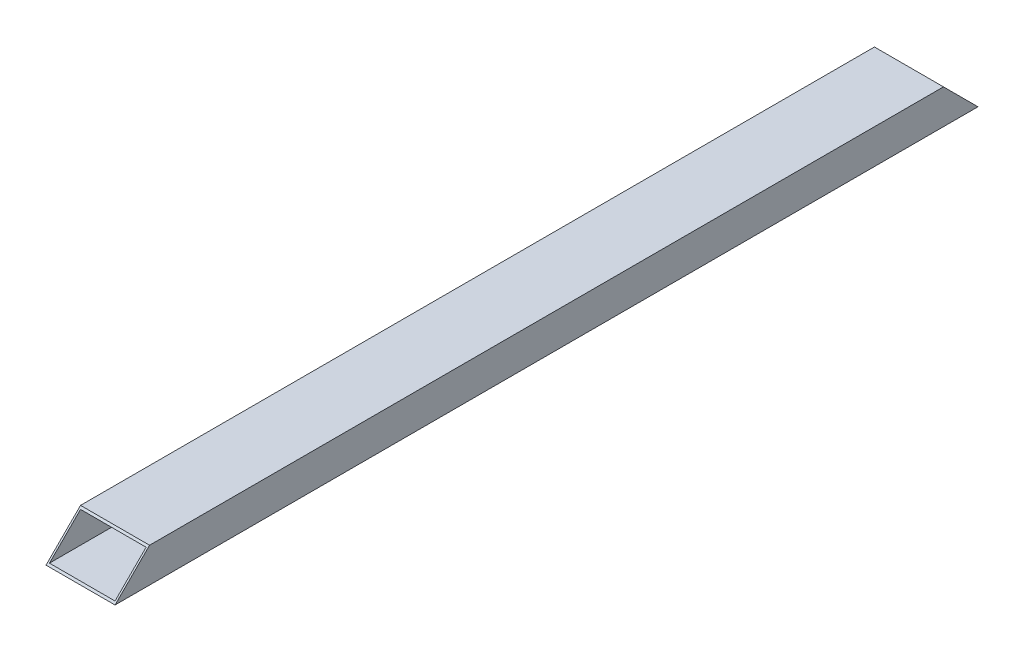
ISO-10303-21;
HEADER;
FILE_DESCRIPTION(('STEP AP214'),'2;1');
FILE_NAME('part.step','',(''),(''),'','','');
FILE_SCHEMA(('AUTOMOTIVE_DESIGN { 1 0 10303 214 1 1 1 1 }'));
ENDSEC;
DATA;
#1=APPLICATION_CONTEXT('core data for automotive mechanical design processes');
#2=APPLICATION_PROTOCOL_DEFINITION('international standard','automotive_design',2000,#1);
#3=PRODUCT_CONTEXT('',#1,'mechanical');
#4=PRODUCT('Part','Part','',(#3));
#5=PRODUCT_RELATED_PRODUCT_CATEGORY('part','',(#4));
#6=PRODUCT_DEFINITION_FORMATION('','',#4);
#7=PRODUCT_DEFINITION_CONTEXT('part definition',#1,'design');
#8=PRODUCT_DEFINITION('design','',#6,#7);
#9=PRODUCT_DEFINITION_SHAPE('','',#8);
#10=(LENGTH_UNIT() NAMED_UNIT(*) SI_UNIT(.MILLI.,.METRE.));
#11=(NAMED_UNIT(*) PLANE_ANGLE_UNIT() SI_UNIT($,.RADIAN.));
#12=(NAMED_UNIT(*) SI_UNIT($,.STERADIAN.) SOLID_ANGLE_UNIT());
#13=UNCERTAINTY_MEASURE_WITH_UNIT(LENGTH_MEASURE(1.E-05),#10,'distance_accuracy_value','');
#14=(GEOMETRIC_REPRESENTATION_CONTEXT(3) GLOBAL_UNCERTAINTY_ASSIGNED_CONTEXT((#13)) GLOBAL_UNIT_ASSIGNED_CONTEXT((#10,
#11,#12)) REPRESENTATION_CONTEXT('',''));
#15=CARTESIAN_POINT('',(0.,0.,0.));
#16=DIRECTION('',(0.,0.,1.));
#17=DIRECTION('',(1.,0.,0.));
#18=AXIS2_PLACEMENT_3D('',#15,#16,#17);
#19=CARTESIAN_POINT('',(-19.,-7.,0.));
#20=DIRECTION('',(0.,-1.,0.));
#21=DIRECTION('',(1.,0.,0.));
#22=AXIS2_PLACEMENT_3D('',#19,#20,#21);
#23=PLANE('',#22);
#24=DIRECTION('',(0.,0.,1.));
#25=VECTOR('',#24,1.);
#26=CARTESIAN_POINT('',(-19.,-7.,0.));
#27=LINE('',#26,#25);
#28=CARTESIAN_POINT('',(-19.,-7.,0.999999999999997));
#29=VERTEX_POINT('',#28);
#30=CARTESIAN_POINT('',(-19.,-7.,499.));
#31=VERTEX_POINT('',#30);
#32=EDGE_CURVE('E144',#29,#31,#27,.T.);
#33=ORIENTED_EDGE('',*,*,#32,.T.);
#34=DIRECTION('',(1.,0.,0.));
#35=VECTOR('',#34,1.);
#36=CARTESIAN_POINT('',(-18.9999999999999,-7.,499.));
#37=LINE('',#36,#35);
#38=CARTESIAN_POINT('',(19.,-6.99999999999999,499.));
#39=VERTEX_POINT('',#38);
#40=EDGE_CURVE('E11',#31,#39,#37,.T.);
#41=ORIENTED_EDGE('',*,*,#40,.T.);
#42=DIRECTION('',(0.,0.,1.));
#43=VECTOR('',#42,1.);
#44=CARTESIAN_POINT('',(19.,-6.99999999999999,0.));
#45=LINE('',#44,#43);
#46=CARTESIAN_POINT('',(19.,-6.99999999999999,0.999999999999999));
#47=VERTEX_POINT('',#46);
#48=EDGE_CURVE('E146',#47,#39,#45,.T.);
#49=ORIENTED_EDGE('',*,*,#48,.F.);
#50=DIRECTION('',(-1.,0.,0.));
#51=VECTOR('',#50,1.);
#52=CARTESIAN_POINT('',(-19.,-7.,0.999999999999994));
#53=LINE('',#52,#51);
#54=EDGE_CURVE('E48',#47,#29,#53,.T.);
#55=ORIENTED_EDGE('',*,*,#54,.T.);
#56=EDGE_LOOP('',(#33,#41,#49,#55));
#57=FACE_BOUND('',#56,.T.);
#58=ADVANCED_FACE('F39',(#57),#23,.F.);
#59=CARTESIAN_POINT('',(19.,-6.99999999999999,0.));
#60=DIRECTION('',(1.,0.,0.));
#61=DIRECTION('',(0.,0.,-1.));
#62=AXIS2_PLACEMENT_3D('',#59,#60,#61);
#63=PLANE('',#62);
#64=ORIENTED_EDGE('',*,*,#48,.T.);
#65=DIRECTION('',(0.,0.707106781186547,-0.707106781186548));
#66=VECTOR('',#65,1.);
#67=CARTESIAN_POINT('',(19.,242.5,249.5));
#68=LINE('',#67,#66);
#69=CARTESIAN_POINT('',(19.,11.,481.));
#70=VERTEX_POINT('',#69);
#71=EDGE_CURVE('E63',#39,#70,#68,.T.);
#72=ORIENTED_EDGE('',*,*,#71,.T.);
#73=DIRECTION('',(0.,0.,1.));
#74=VECTOR('',#73,1.);
#75=CARTESIAN_POINT('',(19.,11.,0.));
#76=LINE('',#75,#74);
#77=CARTESIAN_POINT('',(19.,11.,19.));
#78=VERTEX_POINT('',#77);
#79=EDGE_CURVE('E158',#78,#70,#76,.T.);
#80=ORIENTED_EDGE('',*,*,#79,.F.);
#81=DIRECTION('',(0.,-0.707106781186547,-0.707106781186548));
#82=VECTOR('',#81,1.);
#83=CARTESIAN_POINT('',(19.,-7.5,0.500000000000001));
#84=LINE('',#83,#82);
#85=EDGE_CURVE('E115',#78,#47,#84,.T.);
#86=ORIENTED_EDGE('',*,*,#85,.T.);
#87=EDGE_LOOP('',(#64,#72,#80,#86));
#88=FACE_BOUND('',#87,.T.);
#89=ADVANCED_FACE('F210',(#88),#63,.F.);
#90=CARTESIAN_POINT('',(19.,11.,0.));
#91=DIRECTION('',(0.,1.,0.));
#92=DIRECTION('',(-1.,0.,0.));
#93=AXIS2_PLACEMENT_3D('',#90,#91,#92);
#94=PLANE('',#93);
#95=ORIENTED_EDGE('',*,*,#79,.T.);
#96=DIRECTION('',(-1.,0.,0.));
#97=VECTOR('',#96,1.);
#98=CARTESIAN_POINT('',(19.,11.,481.));
#99=LINE('',#98,#97);
#100=CARTESIAN_POINT('',(-19.,11.,481.));
#101=VERTEX_POINT('',#100);
#102=EDGE_CURVE('E160',#70,#101,#99,.T.);
#103=ORIENTED_EDGE('',*,*,#102,.T.);
#104=DIRECTION('',(0.,0.,1.));
#105=VECTOR('',#104,1.);
#106=CARTESIAN_POINT('',(-19.,11.,0.));
#107=LINE('',#106,#105);
#108=CARTESIAN_POINT('',(-19.,11.,19.));
#109=VERTEX_POINT('',#108);
#110=EDGE_CURVE('E170',#109,#101,#107,.T.);
#111=ORIENTED_EDGE('',*,*,#110,.F.);
#112=DIRECTION('',(1.,0.,0.));
#113=VECTOR('',#112,1.);
#114=CARTESIAN_POINT('',(19.,11.,19.));
#115=LINE('',#114,#113);
#116=EDGE_CURVE('E192',#109,#78,#115,.T.);
#117=ORIENTED_EDGE('',*,*,#116,.T.);
#118=EDGE_LOOP('',(#95,#103,#111,#117));
#119=FACE_BOUND('',#118,.T.);
#120=ADVANCED_FACE('F208',(#119),#94,.F.);
#121=CARTESIAN_POINT('',(-19.,11.,0.));
#122=DIRECTION('',(-1.,0.,0.));
#123=DIRECTION('',(0.,0.,1.));
#124=AXIS2_PLACEMENT_3D('',#121,#122,#123);
#125=PLANE('',#124);
#126=ORIENTED_EDGE('',*,*,#110,.T.);
#127=DIRECTION('',(0.,-0.707106781186547,0.707106781186548));
#128=VECTOR('',#127,1.);
#129=CARTESIAN_POINT('',(-19.,251.5,240.5));
#130=LINE('',#129,#128);
#131=EDGE_CURVE('E153',#101,#31,#130,.T.);
#132=ORIENTED_EDGE('',*,*,#131,.T.);
#133=ORIENTED_EDGE('',*,*,#32,.F.);
#134=DIRECTION('',(0.,0.707106781186547,0.707106781186548));
#135=VECTOR('',#134,1.);
#136=CARTESIAN_POINT('',(-19.,1.5,9.5));
#137=LINE('',#136,#135);
#138=EDGE_CURVE('E55',#29,#109,#137,.T.);
#139=ORIENTED_EDGE('',*,*,#138,.T.);
#140=EDGE_LOOP('',(#126,#132,#133,#139));
#141=FACE_BOUND('',#140,.T.);
#142=ADVANCED_FACE('F151',(#141),#125,.F.);
#143=CARTESIAN_POINT('',(-20.,12.,20.));
#144=DIRECTION('',(0.,-0.707106781186548,0.707106781186547));
#145=DIRECTION('',(0.,-0.707106781186547,-0.707106781186548));
#146=AXIS2_PLACEMENT_3D('',#143,#144,#145);
#147=PLANE('',#146);
#148=DIRECTION('',(0.,-0.707106781186547,-0.707106781186548));
#149=VECTOR('',#148,1.);
#150=CARTESIAN_POINT('',(20.,12.,20.));
#151=LINE('',#150,#149);
#152=CARTESIAN_POINT('',(20.,12.,20.));
#153=VERTEX_POINT('',#152);
#154=CARTESIAN_POINT('',(20.,-7.99999999999999,0.));
#155=VERTEX_POINT('',#154);
#156=EDGE_CURVE('E176',#153,#155,#151,.T.);
#157=ORIENTED_EDGE('',*,*,#156,.T.);
#158=DIRECTION('',(1.,0.,0.));
#159=VECTOR('',#158,1.);
#160=CARTESIAN_POINT('',(20.,-7.99999999999999,0.));
#161=LINE('',#160,#159);
#162=CARTESIAN_POINT('',(-20.,-7.99999999999999,0.));
#163=VERTEX_POINT('',#162);
#164=EDGE_CURVE('E167',#163,#155,#161,.T.);
#165=ORIENTED_EDGE('',*,*,#164,.F.);
#166=DIRECTION('',(0.,-0.707106781186547,-0.707106781186548));
#167=VECTOR('',#166,1.);
#168=CARTESIAN_POINT('',(-20.,12.,20.));
#169=LINE('',#168,#167);
#170=CARTESIAN_POINT('',(-20.,12.,20.));
#171=VERTEX_POINT('',#170);
#172=EDGE_CURVE('E181',#171,#163,#169,.T.);
#173=ORIENTED_EDGE('',*,*,#172,.F.);
#174=DIRECTION('',(1.,0.,0.));
#175=VECTOR('',#174,1.);
#176=CARTESIAN_POINT('',(-20.,12.,20.));
#177=LINE('',#176,#175);
#178=EDGE_CURVE('E129',#171,#153,#177,.T.);
#179=ORIENTED_EDGE('',*,*,#178,.T.);
#180=EDGE_LOOP('',(#157,#165,#173,#179));
#181=FACE_BOUND('',#180,.T.);
#182=ORIENTED_EDGE('',*,*,#54,.F.);
#183=ORIENTED_EDGE('',*,*,#85,.F.);
#184=ORIENTED_EDGE('',*,*,#116,.F.);
#185=ORIENTED_EDGE('',*,*,#138,.F.);
#186=EDGE_LOOP('',(#182,#183,#184,#185));
#187=FACE_BOUND('',#186,.T.);
#188=ADVANCED_FACE('F180',(#181,#187),#147,.F.);
#189=CARTESIAN_POINT('',(-20.,12.,480.));
#190=DIRECTION('',(0.,-0.707106781186548,-0.707106781186547));
#191=DIRECTION('',(0.,0.707106781186547,-0.707106781186548));
#192=AXIS2_PLACEMENT_3D('',#189,#190,#191);
#193=PLANE('',#192);
#194=DIRECTION('',(0.,0.707106781186547,-0.707106781186548));
#195=VECTOR('',#194,1.);
#196=CARTESIAN_POINT('',(20.,12.,480.));
#197=LINE('',#196,#195);
#198=CARTESIAN_POINT('',(20.,-7.99999999999999,500.));
#199=VERTEX_POINT('',#198);
#200=CARTESIAN_POINT('',(20.,12.,480.));
#201=VERTEX_POINT('',#200);
#202=EDGE_CURVE('E109',#199,#201,#197,.T.);
#203=ORIENTED_EDGE('',*,*,#202,.T.);
#204=DIRECTION('',(1.,0.,0.));
#205=VECTOR('',#204,1.);
#206=CARTESIAN_POINT('',(-20.,12.,480.));
#207=LINE('',#206,#205);
#208=CARTESIAN_POINT('',(-20.,12.,480.));
#209=VERTEX_POINT('',#208);
#210=EDGE_CURVE('E103',#209,#201,#207,.T.);
#211=ORIENTED_EDGE('',*,*,#210,.F.);
#212=DIRECTION('',(0.,0.707106781186547,-0.707106781186548));
#213=VECTOR('',#212,1.);
#214=CARTESIAN_POINT('',(-20.,12.,480.));
#215=LINE('',#214,#213);
#216=CARTESIAN_POINT('',(-20.,-8.,500.));
#217=VERTEX_POINT('',#216);
#218=EDGE_CURVE('E106',#217,#209,#215,.T.);
#219=ORIENTED_EDGE('',*,*,#218,.F.);
#220=DIRECTION('',(1.,0.,0.));
#221=VECTOR('',#220,1.);
#222=CARTESIAN_POINT('',(20.,-7.99999999999999,500.));
#223=LINE('',#222,#221);
#224=EDGE_CURVE('E164',#217,#199,#223,.T.);
#225=ORIENTED_EDGE('',*,*,#224,.T.);
#226=EDGE_LOOP('',(#203,#211,#219,#225));
#227=FACE_BOUND('',#226,.T.);
#228=ORIENTED_EDGE('',*,*,#102,.F.);
#229=ORIENTED_EDGE('',*,*,#71,.F.);
#230=ORIENTED_EDGE('',*,*,#40,.F.);
#231=ORIENTED_EDGE('',*,*,#131,.F.);
#232=EDGE_LOOP('',(#228,#229,#230,#231));
#233=FACE_BOUND('',#232,.T.);
#234=ADVANCED_FACE('F105',(#227,#233),#193,.F.);
#235=CARTESIAN_POINT('',(20.,-7.99999999999999,500.));
#236=DIRECTION('',(-1.,0.,0.));
#237=DIRECTION('',(0.,0.,1.));
#238=AXIS2_PLACEMENT_3D('',#235,#236,#237);
#239=PLANE('',#238);
#240=DIRECTION('',(0.,0.,-1.));
#241=VECTOR('',#240,1.);
#242=CARTESIAN_POINT('',(20.,12.,500.));
#243=LINE('',#242,#241);
#244=EDGE_CURVE('E131',#201,#153,#243,.T.);
#245=ORIENTED_EDGE('',*,*,#244,.F.);
#246=ORIENTED_EDGE('',*,*,#202,.F.);
#247=DIRECTION('',(0.,0.,-1.));
#248=VECTOR('',#247,1.);
#249=CARTESIAN_POINT('',(20.,-7.99999999999999,500.));
#250=LINE('',#249,#248);
#251=EDGE_CURVE('E136',#199,#155,#250,.T.);
#252=ORIENTED_EDGE('',*,*,#251,.T.);
#253=ORIENTED_EDGE('',*,*,#156,.F.);
#254=EDGE_LOOP('',(#245,#246,#252,#253));
#255=FACE_BOUND('',#254,.T.);
#256=ADVANCED_FACE('F41',(#255),#239,.F.);
#257=CARTESIAN_POINT('',(-20.,12.,500.));
#258=DIRECTION('',(0.,-1.,0.));
#259=DIRECTION('',(1.,0.,0.));
#260=AXIS2_PLACEMENT_3D('',#257,#258,#259);
#261=PLANE('',#260);
#262=DIRECTION('',(0.,0.,-1.));
#263=VECTOR('',#262,1.);
#264=CARTESIAN_POINT('',(-20.,12.,500.));
#265=LINE('',#264,#263);
#266=EDGE_CURVE('E121',#209,#171,#265,.T.);
#267=ORIENTED_EDGE('',*,*,#266,.F.);
#268=ORIENTED_EDGE('',*,*,#210,.T.);
#269=ORIENTED_EDGE('',*,*,#244,.T.);
#270=ORIENTED_EDGE('',*,*,#178,.F.);
#271=EDGE_LOOP('',(#267,#268,#269,#270));
#272=FACE_BOUND('',#271,.T.);
#273=ADVANCED_FACE('F128',(#272),#261,.F.);
#274=CARTESIAN_POINT('',(-20.,-8.,500.));
#275=DIRECTION('',(1.,0.,0.));
#276=DIRECTION('',(0.,0.,-1.));
#277=AXIS2_PLACEMENT_3D('',#274,#275,#276);
#278=PLANE('',#277);
#279=DIRECTION('',(0.,0.,-1.));
#280=VECTOR('',#279,1.);
#281=CARTESIAN_POINT('',(-20.,-8.,500.));
#282=LINE('',#281,#280);
#283=EDGE_CURVE('E123',#217,#163,#282,.T.);
#284=ORIENTED_EDGE('',*,*,#283,.F.);
#285=ORIENTED_EDGE('',*,*,#218,.T.);
#286=ORIENTED_EDGE('',*,*,#266,.T.);
#287=ORIENTED_EDGE('',*,*,#172,.T.);
#288=EDGE_LOOP('',(#284,#285,#286,#287));
#289=FACE_BOUND('',#288,.T.);
#290=ADVANCED_FACE('F119',(#289),#278,.F.);
#291=CARTESIAN_POINT('',(20.,-7.99999999999999,500.));
#292=DIRECTION('',(0.,1.,0.));
#293=DIRECTION('',(-1.,0.,0.));
#294=AXIS2_PLACEMENT_3D('',#291,#292,#293);
#295=PLANE('',#294);
#296=ORIENTED_EDGE('',*,*,#164,.T.);
#297=ORIENTED_EDGE('',*,*,#251,.F.);
#298=ORIENTED_EDGE('',*,*,#224,.F.);
#299=ORIENTED_EDGE('',*,*,#283,.T.);
#300=EDGE_LOOP('',(#296,#297,#298,#299));
#301=FACE_BOUND('',#300,.T.);
#302=ADVANCED_FACE('F178',(#301),#295,.F.);
#303=CLOSED_SHELL('',(#58,#89,#120,#142,#188,#234,#256,#273,#290,#302));
#304=MANIFOLD_SOLID_BREP('B2',#303);
#305=ADVANCED_BREP_SHAPE_REPRESENTATION('',(#18,#304),#14);
#306=SHAPE_DEFINITION_REPRESENTATION(#9,#305);
ENDSEC;
END-ISO-10303-21;
